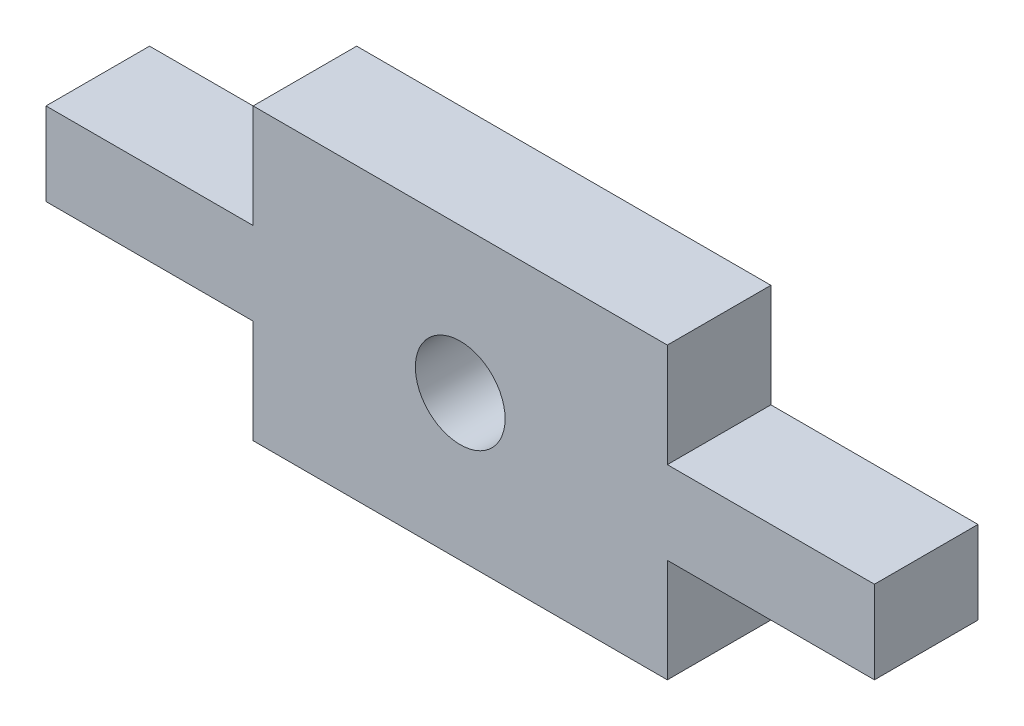
ISO-10303-21;
HEADER;
FILE_DESCRIPTION(('STEP AP214'),'2;1');
FILE_NAME('part.step','',(''),(''),'','','');
FILE_SCHEMA(('AUTOMOTIVE_DESIGN { 1 0 10303 214 1 1 1 1 }'));
ENDSEC;
DATA;
#1=APPLICATION_CONTEXT('core data for automotive mechanical design processes');
#2=APPLICATION_PROTOCOL_DEFINITION('international standard','automotive_design',2000,#1);
#3=PRODUCT_CONTEXT('',#1,'mechanical');
#4=PRODUCT('Part','Part','',(#3));
#5=PRODUCT_RELATED_PRODUCT_CATEGORY('part','',(#4));
#6=PRODUCT_DEFINITION_FORMATION('','',#4);
#7=PRODUCT_DEFINITION_CONTEXT('part definition',#1,'design');
#8=PRODUCT_DEFINITION('design','',#6,#7);
#9=PRODUCT_DEFINITION_SHAPE('','',#8);
#10=(LENGTH_UNIT() NAMED_UNIT(*) SI_UNIT(.MILLI.,.METRE.));
#11=(NAMED_UNIT(*) PLANE_ANGLE_UNIT() SI_UNIT($,.RADIAN.));
#12=(NAMED_UNIT(*) SI_UNIT($,.STERADIAN.) SOLID_ANGLE_UNIT());
#13=UNCERTAINTY_MEASURE_WITH_UNIT(LENGTH_MEASURE(1.E-05),#10,'distance_accuracy_value','');
#14=(GEOMETRIC_REPRESENTATION_CONTEXT(3) GLOBAL_UNCERTAINTY_ASSIGNED_CONTEXT((#13)) GLOBAL_UNIT_ASSIGNED_CONTEXT((#10,
#11,#12)) REPRESENTATION_CONTEXT('',''));
#15=CARTESIAN_POINT('',(0.,0.,0.));
#16=DIRECTION('',(0.,0.,1.));
#17=DIRECTION('',(1.,0.,0.));
#18=AXIS2_PLACEMENT_3D('',#15,#16,#17);
#19=CARTESIAN_POINT('',(0.,0.,3.));
#20=DIRECTION('',(0.,0.,-1.));
#21=DIRECTION('',(-1.,0.,0.));
#22=AXIS2_PLACEMENT_3D('',#19,#20,#21);
#23=PLANE('',#22);
#24=DIRECTION('',(0.,-1.,0.));
#25=VECTOR('',#24,1.);
#26=CARTESIAN_POINT('',(47.9999736591955,38.2000662736907,3.));
#27=LINE('',#26,#25);
#28=CARTESIAN_POINT('',(47.9999736591955,38.2000662736907,3.));
#29=VERTEX_POINT('',#28);
#30=CARTESIAN_POINT('',(47.9999736591955,35.8000044369874,3.));
#31=VERTEX_POINT('',#30);
#32=EDGE_CURVE('E177',#29,#31,#27,.T.);
#33=ORIENTED_EDGE('',*,*,#32,.T.);
#34=DIRECTION('',(0.999999999930556,1.17850871429143E-05,0.));
#35=VECTOR('',#34,1.);
#36=CARTESIAN_POINT('',(47.9999736591955,35.8000044369874,3.));
#37=LINE('',#36,#35);
#38=CARTESIAN_POINT('',(53.9999868295979,35.8000751476655,3.));
#39=VERTEX_POINT('',#38);
#40=EDGE_CURVE('E105',#31,#39,#37,.T.);
#41=ORIENTED_EDGE('',*,*,#40,.T.);
#42=DIRECTION('',(4.71386819660799E-05,-0.999999998888972,0.));
#43=VECTOR('',#42,1.);
#44=CARTESIAN_POINT('',(53.9999868295979,35.8000751476655,3.));
#45=LINE('',#44,#43);
#46=CARTESIAN_POINT('',(54.0001282509541,32.7999624964473,3.));
#47=VERTEX_POINT('',#46);
#48=EDGE_CURVE('E204',#39,#47,#45,.T.);
#49=ORIENTED_EDGE('',*,*,#48,.T.);
#50=DIRECTION('',(1.,0.,0.));
#51=VECTOR('',#50,1.);
#52=CARTESIAN_POINT('',(66.0000131704022,32.7999624964472,3.));
#53=LINE('',#52,#51);
#54=CARTESIAN_POINT('',(66.0000131704022,32.7999624964472,3.));
#55=VERTEX_POINT('',#54);
#56=EDGE_CURVE('E223',#47,#55,#53,.T.);
#57=ORIENTED_EDGE('',*,*,#56,.T.);
#58=DIRECTION('',(0.,1.,0.));
#59=VECTOR('',#58,1.);
#60=CARTESIAN_POINT('',(66.0000131704022,35.8000751476655,3.));
#61=LINE('',#60,#59);
#62=CARTESIAN_POINT('',(66.0000131704022,35.8000751476655,3.));
#63=VERTEX_POINT('',#62);
#64=EDGE_CURVE('E220',#55,#63,#61,.T.);
#65=ORIENTED_EDGE('',*,*,#64,.T.);
#66=DIRECTION('',(0.999999999930556,-1.17850871429145E-05,0.));
#67=VECTOR('',#66,1.);
#68=CARTESIAN_POINT('',(66.0000131704022,35.8000751476655,3.));
#69=LINE('',#68,#67);
#70=CARTESIAN_POINT('',(72.0000263408045,35.8000044369874,3.));
#71=VERTEX_POINT('',#70);
#72=EDGE_CURVE('E222',#63,#71,#69,.T.);
#73=ORIENTED_EDGE('',*,*,#72,.T.);
#74=DIRECTION('',(0.,1.,0.));
#75=VECTOR('',#74,1.);
#76=CARTESIAN_POINT('',(72.0000263408045,38.2000662736908,3.));
#77=LINE('',#76,#75);
#78=CARTESIAN_POINT('',(72.0000263408045,38.2000662736908,3.));
#79=VERTEX_POINT('',#78);
#80=EDGE_CURVE('E225',#71,#79,#77,.T.);
#81=ORIENTED_EDGE('',*,*,#80,.T.);
#82=DIRECTION('',(-0.999999999722217,-2.35704484027615E-05,0.));
#83=VECTOR('',#82,1.);
#84=CARTESIAN_POINT('',(66.0000838810803,38.1999248523566,3.));
#85=LINE('',#84,#83);
#86=CARTESIAN_POINT('',(66.0000838810803,38.1999248523566,3.));
#87=VERTEX_POINT('',#86);
#88=EDGE_CURVE('E231',#79,#87,#85,.T.);
#89=ORIENTED_EDGE('',*,*,#88,.T.);
#90=DIRECTION('',(-2.35698965170594E-05,0.99999999972223,0.));
#91=VECTOR('',#90,1.);
#92=CARTESIAN_POINT('',(66.0000838810803,38.1999248523566,3.));
#93=LINE('',#92,#91);
#94=CARTESIAN_POINT('',(66.0000131704022,41.1999667928747,3.));
#95=VERTEX_POINT('',#94);
#96=EDGE_CURVE('E136',#87,#95,#93,.T.);
#97=ORIENTED_EDGE('',*,*,#96,.T.);
#98=DIRECTION('',(-0.999999999982639,5.89257829808623E-06,0.));
#99=VECTOR('',#98,1.);
#100=CARTESIAN_POINT('',(66.0000131704022,41.1999667928747,3.));
#101=LINE('',#100,#99);
#102=CARTESIAN_POINT('',(54.0000575402759,41.2000375035528,3.));
#103=VERTEX_POINT('',#102);
#104=EDGE_CURVE('E130',#95,#103,#101,.T.);
#105=ORIENTED_EDGE('',*,*,#104,.T.);
#106=DIRECTION('',(-2.35698965526502E-05,-0.99999999972223,0.));
#107=VECTOR('',#106,1.);
#108=CARTESIAN_POINT('',(54.0000575402759,41.2000375035528,3.));
#109=LINE('',#108,#107);
#110=CARTESIAN_POINT('',(53.9999868295977,38.1999955628545,3.));
#111=VERTEX_POINT('',#110);
#112=EDGE_CURVE('E134',#103,#111,#109,.T.);
#113=ORIENTED_EDGE('',*,*,#112,.T.);
#114=DIRECTION('',(-0.999999999930556,1.17851134979322E-05,0.));
#115=VECTOR('',#114,1.);
#116=CARTESIAN_POINT('',(47.9999736591955,38.2000662736907,3.));
#117=LINE('',#116,#115);
#118=EDGE_CURVE('E50',#111,#29,#117,.T.);
#119=ORIENTED_EDGE('',*,*,#118,.T.);
#120=EDGE_LOOP('',(#33,#41,#49,#57,#65,#73,#81,#89,#97,#105,#113,#119));
#121=FACE_BOUND('',#120,.T.);
#122=CARTESIAN_POINT('',(60.0000707106777,36.999964644661,3.));
#123=DIRECTION('',(0.,0.,1.));
#124=DIRECTION('',(1.,0.,0.));
#125=AXIS2_PLACEMENT_3D('',#122,#123,#124);
#126=CIRCLE('',#125,1.29995000096183);
#127=CARTESIAN_POINT('',(61.3000207116396,36.999964644661,3.));
#128=VERTEX_POINT('',#127);
#129=EDGE_CURVE('E158',#128,#128,#126,.T.);
#130=ORIENTED_EDGE('',*,*,#129,.F.);
#131=EDGE_LOOP('',(#130));
#132=FACE_BOUND('',#131,.T.);
#133=ADVANCED_FACE('F33',(#121,#132),#23,.F.);
#134=CARTESIAN_POINT('',(0.,0.,0.));
#135=DIRECTION('',(0.,0.,-1.));
#136=DIRECTION('',(-1.,0.,0.));
#137=AXIS2_PLACEMENT_3D('',#134,#135,#136);
#138=PLANE('',#137);
#139=DIRECTION('',(0.,-1.,0.));
#140=VECTOR('',#139,1.);
#141=CARTESIAN_POINT('',(47.9999736591955,38.2000662736907,0.));
#142=LINE('',#141,#140);
#143=CARTESIAN_POINT('',(47.9999736591955,38.2000662736907,0.));
#144=VERTEX_POINT('',#143);
#145=CARTESIAN_POINT('',(47.9999736591955,35.8000044369874,0.));
#146=VERTEX_POINT('',#145);
#147=EDGE_CURVE('E154',#144,#146,#142,.T.);
#148=ORIENTED_EDGE('',*,*,#147,.F.);
#149=DIRECTION('',(-0.999999999930556,1.17851134979322E-05,0.));
#150=VECTOR('',#149,1.);
#151=CARTESIAN_POINT('',(47.9999736591955,38.2000662736907,0.));
#152=LINE('',#151,#150);
#153=CARTESIAN_POINT('',(53.9999868295977,38.1999955628545,0.));
#154=VERTEX_POINT('',#153);
#155=EDGE_CURVE('E97',#154,#144,#152,.T.);
#156=ORIENTED_EDGE('',*,*,#155,.F.);
#157=DIRECTION('',(-2.35698965526502E-05,-0.99999999972223,0.));
#158=VECTOR('',#157,1.);
#159=CARTESIAN_POINT('',(54.0000575402759,41.2000375035528,0.));
#160=LINE('',#159,#158);
#161=CARTESIAN_POINT('',(54.0000575402759,41.2000375035528,0.));
#162=VERTEX_POINT('',#161);
#163=EDGE_CURVE('E91',#162,#154,#160,.T.);
#164=ORIENTED_EDGE('',*,*,#163,.F.);
#165=DIRECTION('',(-0.999999999982639,5.89257829808623E-06,0.));
#166=VECTOR('',#165,1.);
#167=CARTESIAN_POINT('',(66.0000131704022,41.1999667928747,0.));
#168=LINE('',#167,#166);
#169=CARTESIAN_POINT('',(66.0000131704022,41.1999667928747,0.));
#170=VERTEX_POINT('',#169);
#171=EDGE_CURVE('E144',#170,#162,#168,.T.);
#172=ORIENTED_EDGE('',*,*,#171,.F.);
#173=DIRECTION('',(-2.35698965170594E-05,0.99999999972223,0.));
#174=VECTOR('',#173,1.);
#175=CARTESIAN_POINT('',(66.0000838810803,38.1999248523566,0.));
#176=LINE('',#175,#174);
#177=CARTESIAN_POINT('',(66.0000838810803,38.1999248523566,0.));
#178=VERTEX_POINT('',#177);
#179=EDGE_CURVE('E172',#178,#170,#176,.T.);
#180=ORIENTED_EDGE('',*,*,#179,.F.);
#181=DIRECTION('',(-0.999999999722217,-2.35704484027615E-05,0.));
#182=VECTOR('',#181,1.);
#183=CARTESIAN_POINT('',(66.0000838810803,38.1999248523566,0.));
#184=LINE('',#183,#182);
#185=CARTESIAN_POINT('',(72.0000263408045,38.2000662736908,0.));
#186=VERTEX_POINT('',#185);
#187=EDGE_CURVE('E170',#186,#178,#184,.T.);
#188=ORIENTED_EDGE('',*,*,#187,.F.);
#189=DIRECTION('',(0.,1.,0.));
#190=VECTOR('',#189,1.);
#191=CARTESIAN_POINT('',(72.0000263408045,38.2000662736908,0.));
#192=LINE('',#191,#190);
#193=CARTESIAN_POINT('',(72.0000263408045,35.8000044369874,0.));
#194=VERTEX_POINT('',#193);
#195=EDGE_CURVE('E168',#194,#186,#192,.T.);
#196=ORIENTED_EDGE('',*,*,#195,.F.);
#197=DIRECTION('',(0.999999999930556,-1.17850871429145E-05,0.));
#198=VECTOR('',#197,1.);
#199=CARTESIAN_POINT('',(66.0000131704022,35.8000751476655,0.));
#200=LINE('',#199,#198);
#201=CARTESIAN_POINT('',(66.0000131704022,35.8000751476655,0.));
#202=VERTEX_POINT('',#201);
#203=EDGE_CURVE('E166',#202,#194,#200,.T.);
#204=ORIENTED_EDGE('',*,*,#203,.F.);
#205=DIRECTION('',(0.,1.,0.));
#206=VECTOR('',#205,1.);
#207=CARTESIAN_POINT('',(66.0000131704022,35.8000751476655,0.));
#208=LINE('',#207,#206);
#209=CARTESIAN_POINT('',(66.0000131704022,32.7999624964472,0.));
#210=VERTEX_POINT('',#209);
#211=EDGE_CURVE('E164',#210,#202,#208,.T.);
#212=ORIENTED_EDGE('',*,*,#211,.F.);
#213=DIRECTION('',(1.,0.,0.));
#214=VECTOR('',#213,1.);
#215=CARTESIAN_POINT('',(66.0000131704022,32.7999624964472,0.));
#216=LINE('',#215,#214);
#217=CARTESIAN_POINT('',(54.0001282509541,32.7999624964473,0.));
#218=VERTEX_POINT('',#217);
#219=EDGE_CURVE('E162',#218,#210,#216,.T.);
#220=ORIENTED_EDGE('',*,*,#219,.F.);
#221=DIRECTION('',(4.71386819660799E-05,-0.999999998888972,0.));
#222=VECTOR('',#221,1.);
#223=CARTESIAN_POINT('',(53.9999868295979,35.8000751476655,0.));
#224=LINE('',#223,#222);
#225=CARTESIAN_POINT('',(53.9999868295979,35.8000751476655,0.));
#226=VERTEX_POINT('',#225);
#227=EDGE_CURVE('E160',#226,#218,#224,.T.);
#228=ORIENTED_EDGE('',*,*,#227,.F.);
#229=DIRECTION('',(0.999999999930556,1.17850871429143E-05,0.));
#230=VECTOR('',#229,1.);
#231=CARTESIAN_POINT('',(47.9999736591955,35.8000044369874,0.));
#232=LINE('',#231,#230);
#233=EDGE_CURVE('E157',#146,#226,#232,.T.);
#234=ORIENTED_EDGE('',*,*,#233,.F.);
#235=EDGE_LOOP('',(#148,#156,#164,#172,#180,#188,#196,#204,#212,#220,#228,#234));
#236=FACE_BOUND('',#235,.T.);
#237=CARTESIAN_POINT('',(60.0000707106777,36.999964644661,0.));
#238=DIRECTION('',(0.,0.,1.));
#239=DIRECTION('',(1.,0.,0.));
#240=AXIS2_PLACEMENT_3D('',#237,#238,#239);
#241=CIRCLE('',#240,1.29995000096183);
#242=CARTESIAN_POINT('',(61.3000207116396,36.999964644661,0.));
#243=VERTEX_POINT('',#242);
#244=EDGE_CURVE('E378',#243,#243,#241,.T.);
#245=ORIENTED_EDGE('',*,*,#244,.T.);
#246=EDGE_LOOP('',(#245));
#247=FACE_BOUND('',#246,.T.);
#248=ADVANCED_FACE('F208',(#236,#247),#138,.T.);
#249=CARTESIAN_POINT('',(47.9999736591955,38.2000662736907,3.));
#250=DIRECTION('',(1.,0.,0.));
#251=DIRECTION('',(0.,0.,-1.));
#252=AXIS2_PLACEMENT_3D('',#249,#250,#251);
#253=PLANE('',#252);
#254=ORIENTED_EDGE('',*,*,#147,.T.);
#255=DIRECTION('',(0.,0.,-1.));
#256=VECTOR('',#255,1.);
#257=CARTESIAN_POINT('',(47.9999736591955,35.8000044369874,3.));
#258=LINE('',#257,#256);
#259=EDGE_CURVE('E11',#31,#146,#258,.T.);
#260=ORIENTED_EDGE('',*,*,#259,.F.);
#261=ORIENTED_EDGE('',*,*,#32,.F.);
#262=DIRECTION('',(0.,0.,-1.));
#263=VECTOR('',#262,1.);
#264=CARTESIAN_POINT('',(47.9999736591955,38.2000662736907,3.));
#265=LINE('',#264,#263);
#266=EDGE_CURVE('E150',#29,#144,#265,.T.);
#267=ORIENTED_EDGE('',*,*,#266,.T.);
#268=EDGE_LOOP('',(#254,#260,#261,#267));
#269=FACE_BOUND('',#268,.T.);
#270=ADVANCED_FACE('F35',(#269),#253,.F.);
#271=CARTESIAN_POINT('',(47.9999736591955,35.8000044369874,3.));
#272=DIRECTION('',(-1.17850871429143E-05,0.999999999930556,0.));
#273=DIRECTION('',(-0.999999999930556,-1.17850871429143E-05,0.));
#274=AXIS2_PLACEMENT_3D('',#271,#272,#273);
#275=PLANE('',#274);
#276=ORIENTED_EDGE('',*,*,#233,.T.);
#277=DIRECTION('',(0.,0.,-1.));
#278=VECTOR('',#277,1.);
#279=CARTESIAN_POINT('',(53.9999868295979,35.8000751476655,3.));
#280=LINE('',#279,#278);
#281=EDGE_CURVE('E42',#39,#226,#280,.T.);
#282=ORIENTED_EDGE('',*,*,#281,.F.);
#283=ORIENTED_EDGE('',*,*,#40,.F.);
#284=ORIENTED_EDGE('',*,*,#259,.T.);
#285=EDGE_LOOP('',(#276,#282,#283,#284));
#286=FACE_BOUND('',#285,.T.);
#287=ADVANCED_FACE('F265',(#286),#275,.F.);
#288=CARTESIAN_POINT('',(53.9999868295979,35.8000751476655,3.));
#289=DIRECTION('',(0.999999998888972,4.71386819660799E-05,0.));
#290=DIRECTION('',(-4.71386819660799E-05,0.999999998888972,0.));
#291=AXIS2_PLACEMENT_3D('',#288,#289,#290);
#292=PLANE('',#291);
#293=ORIENTED_EDGE('',*,*,#227,.T.);
#294=DIRECTION('',(0.,0.,-1.));
#295=VECTOR('',#294,1.);
#296=CARTESIAN_POINT('',(54.0001282509541,32.7999624964473,3.));
#297=LINE('',#296,#295);
#298=EDGE_CURVE('E196',#47,#218,#297,.T.);
#299=ORIENTED_EDGE('',*,*,#298,.F.);
#300=ORIENTED_EDGE('',*,*,#48,.F.);
#301=ORIENTED_EDGE('',*,*,#281,.T.);
#302=EDGE_LOOP('',(#293,#299,#300,#301));
#303=FACE_BOUND('',#302,.T.);
#304=ADVANCED_FACE('F202',(#303),#292,.F.);
#305=CARTESIAN_POINT('',(66.0000131704022,32.7999624964472,3.));
#306=DIRECTION('',(0.,1.,0.));
#307=DIRECTION('',(-1.,0.,0.));
#308=AXIS2_PLACEMENT_3D('',#305,#306,#307);
#309=PLANE('',#308);
#310=ORIENTED_EDGE('',*,*,#219,.T.);
#311=DIRECTION('',(0.,0.,-1.));
#312=VECTOR('',#311,1.);
#313=CARTESIAN_POINT('',(66.0000131704022,32.7999624964472,3.));
#314=LINE('',#313,#312);
#315=EDGE_CURVE('E193',#55,#210,#314,.T.);
#316=ORIENTED_EDGE('',*,*,#315,.F.);
#317=ORIENTED_EDGE('',*,*,#56,.F.);
#318=ORIENTED_EDGE('',*,*,#298,.T.);
#319=EDGE_LOOP('',(#310,#316,#317,#318));
#320=FACE_BOUND('',#319,.T.);
#321=ADVANCED_FACE('F214',(#320),#309,.F.);
#322=CARTESIAN_POINT('',(66.0000131704022,35.8000751476655,3.));
#323=DIRECTION('',(-1.,0.,0.));
#324=DIRECTION('',(0.,0.,1.));
#325=AXIS2_PLACEMENT_3D('',#322,#323,#324);
#326=PLANE('',#325);
#327=ORIENTED_EDGE('',*,*,#211,.T.);
#328=DIRECTION('',(0.,0.,-1.));
#329=VECTOR('',#328,1.);
#330=CARTESIAN_POINT('',(66.0000131704022,35.8000751476655,3.));
#331=LINE('',#330,#329);
#332=EDGE_CURVE('E190',#63,#202,#331,.T.);
#333=ORIENTED_EDGE('',*,*,#332,.F.);
#334=ORIENTED_EDGE('',*,*,#64,.F.);
#335=ORIENTED_EDGE('',*,*,#315,.T.);
#336=EDGE_LOOP('',(#327,#333,#334,#335));
#337=FACE_BOUND('',#336,.T.);
#338=ADVANCED_FACE('F218',(#337),#326,.F.);
#339=CARTESIAN_POINT('',(66.0000131704022,35.8000751476655,3.));
#340=DIRECTION('',(1.17850871429145E-05,0.999999999930556,0.));
#341=DIRECTION('',(-0.999999999930556,1.17850871429145E-05,0.));
#342=AXIS2_PLACEMENT_3D('',#339,#340,#341);
#343=PLANE('',#342);
#344=ORIENTED_EDGE('',*,*,#203,.T.);
#345=DIRECTION('',(0.,0.,-1.));
#346=VECTOR('',#345,1.);
#347=CARTESIAN_POINT('',(72.0000263408045,35.8000044369874,3.));
#348=LINE('',#347,#346);
#349=EDGE_CURVE('E187',#71,#194,#348,.T.);
#350=ORIENTED_EDGE('',*,*,#349,.F.);
#351=ORIENTED_EDGE('',*,*,#72,.F.);
#352=ORIENTED_EDGE('',*,*,#332,.T.);
#353=EDGE_LOOP('',(#344,#350,#351,#352));
#354=FACE_BOUND('',#353,.T.);
#355=ADVANCED_FACE('F278',(#354),#343,.F.);
#356=CARTESIAN_POINT('',(72.0000263408045,38.2000662736908,3.));
#357=DIRECTION('',(-1.,0.,0.));
#358=DIRECTION('',(0.,0.,1.));
#359=AXIS2_PLACEMENT_3D('',#356,#357,#358);
#360=PLANE('',#359);
#361=ORIENTED_EDGE('',*,*,#195,.T.);
#362=DIRECTION('',(0.,0.,-1.));
#363=VECTOR('',#362,1.);
#364=CARTESIAN_POINT('',(72.0000263408045,38.2000662736908,3.));
#365=LINE('',#364,#363);
#366=EDGE_CURVE('E184',#79,#186,#365,.T.);
#367=ORIENTED_EDGE('',*,*,#366,.F.);
#368=ORIENTED_EDGE('',*,*,#80,.F.);
#369=ORIENTED_EDGE('',*,*,#349,.T.);
#370=EDGE_LOOP('',(#361,#367,#368,#369));
#371=FACE_BOUND('',#370,.T.);
#372=ADVANCED_FACE('F281',(#371),#360,.F.);
#373=CARTESIAN_POINT('',(66.0000838810803,38.1999248523566,3.));
#374=DIRECTION('',(2.35704484027615E-05,-0.999999999722217,0.));
#375=DIRECTION('',(0.999999999722217,2.35704484027615E-05,0.));
#376=AXIS2_PLACEMENT_3D('',#373,#374,#375);
#377=PLANE('',#376);
#378=ORIENTED_EDGE('',*,*,#187,.T.);
#379=DIRECTION('',(0.,0.,-1.));
#380=VECTOR('',#379,1.);
#381=CARTESIAN_POINT('',(66.0000838810803,38.1999248523566,3.));
#382=LINE('',#381,#380);
#383=EDGE_CURVE('E181',#87,#178,#382,.T.);
#384=ORIENTED_EDGE('',*,*,#383,.F.);
#385=ORIENTED_EDGE('',*,*,#88,.F.);
#386=ORIENTED_EDGE('',*,*,#366,.T.);
#387=EDGE_LOOP('',(#378,#384,#385,#386));
#388=FACE_BOUND('',#387,.T.);
#389=ADVANCED_FACE('F237',(#388),#377,.F.);
#390=CARTESIAN_POINT('',(66.0000838810803,38.1999248523566,3.));
#391=DIRECTION('',(-0.99999999972223,-2.35698965170594E-05,0.));
#392=DIRECTION('',(2.35698965170594E-05,-0.99999999972223,0.));
#393=AXIS2_PLACEMENT_3D('',#390,#391,#392);
#394=PLANE('',#393);
#395=ORIENTED_EDGE('',*,*,#179,.T.);
#396=DIRECTION('',(0.,0.,-1.));
#397=VECTOR('',#396,1.);
#398=CARTESIAN_POINT('',(66.0000131704022,41.1999667928747,3.));
#399=LINE('',#398,#397);
#400=EDGE_CURVE('E145',#95,#170,#399,.T.);
#401=ORIENTED_EDGE('',*,*,#400,.F.);
#402=ORIENTED_EDGE('',*,*,#96,.F.);
#403=ORIENTED_EDGE('',*,*,#383,.T.);
#404=EDGE_LOOP('',(#395,#401,#402,#403));
#405=FACE_BOUND('',#404,.T.);
#406=ADVANCED_FACE('F241',(#405),#394,.F.);
#407=CARTESIAN_POINT('',(66.0000131704022,41.1999667928747,3.));
#408=DIRECTION('',(-5.89257829808623E-06,-0.999999999982639,0.));
#409=DIRECTION('',(0.999999999982639,-5.89257829808623E-06,0.));
#410=AXIS2_PLACEMENT_3D('',#407,#408,#409);
#411=PLANE('',#410);
#412=ORIENTED_EDGE('',*,*,#171,.T.);
#413=DIRECTION('',(0.,0.,-1.));
#414=VECTOR('',#413,1.);
#415=CARTESIAN_POINT('',(54.0000575402759,41.2000375035528,3.));
#416=LINE('',#415,#414);
#417=EDGE_CURVE('E141',#103,#162,#416,.T.);
#418=ORIENTED_EDGE('',*,*,#417,.F.);
#419=ORIENTED_EDGE('',*,*,#104,.F.);
#420=ORIENTED_EDGE('',*,*,#400,.T.);
#421=EDGE_LOOP('',(#412,#418,#419,#420));
#422=FACE_BOUND('',#421,.T.);
#423=ADVANCED_FACE('F142',(#422),#411,.F.);
#424=CARTESIAN_POINT('',(54.0000575402759,41.2000375035528,3.));
#425=DIRECTION('',(0.99999999972223,-2.35698965526502E-05,0.));
#426=DIRECTION('',(2.35698965526502E-05,0.99999999972223,0.));
#427=AXIS2_PLACEMENT_3D('',#424,#425,#426);
#428=PLANE('',#427);
#429=ORIENTED_EDGE('',*,*,#163,.T.);
#430=DIRECTION('',(0.,0.,-1.));
#431=VECTOR('',#430,1.);
#432=CARTESIAN_POINT('',(53.9999868295977,38.1999955628545,3.));
#433=LINE('',#432,#431);
#434=EDGE_CURVE('E146',#111,#154,#433,.T.);
#435=ORIENTED_EDGE('',*,*,#434,.F.);
#436=ORIENTED_EDGE('',*,*,#112,.F.);
#437=ORIENTED_EDGE('',*,*,#417,.T.);
#438=EDGE_LOOP('',(#429,#435,#436,#437));
#439=FACE_BOUND('',#438,.T.);
#440=ADVANCED_FACE('F148',(#439),#428,.F.);
#441=CARTESIAN_POINT('',(47.9999736591955,38.2000662736907,3.));
#442=DIRECTION('',(-1.17851134979322E-05,-0.999999999930556,0.));
#443=DIRECTION('',(0.999999999930556,-1.17851134979322E-05,0.));
#444=AXIS2_PLACEMENT_3D('',#441,#442,#443);
#445=PLANE('',#444);
#446=ORIENTED_EDGE('',*,*,#155,.T.);
#447=ORIENTED_EDGE('',*,*,#266,.F.);
#448=ORIENTED_EDGE('',*,*,#118,.F.);
#449=ORIENTED_EDGE('',*,*,#434,.T.);
#450=EDGE_LOOP('',(#446,#447,#448,#449));
#451=FACE_BOUND('',#450,.T.);
#452=ADVANCED_FACE('F245',(#451),#445,.F.);
#453=CARTESIAN_POINT('',(60.0000707106777,36.999964644661,3.));
#454=DIRECTION('',(0.,0.,-1.));
#455=DIRECTION('',(-1.,0.,0.));
#456=AXIS2_PLACEMENT_3D('',#453,#454,#455);
#457=CYLINDRICAL_SURFACE('',#456,1.29995000096183);
#458=ORIENTED_EDGE('',*,*,#129,.T.);
#459=EDGE_LOOP('',(#458));
#460=FACE_BOUND('',#459,.T.);
#461=ORIENTED_EDGE('',*,*,#244,.F.);
#462=EDGE_LOOP('',(#461));
#463=FACE_BOUND('',#462,.T.);
#464=ADVANCED_FACE('F247',(#460,#463),#457,.F.);
#465=CLOSED_SHELL('',(#133,#248,#270,#287,#304,#321,#338,#355,#372,#389,#406,#423,#440,#452,#464));
#466=MANIFOLD_SOLID_BREP('B2',#465);
#467=ADVANCED_BREP_SHAPE_REPRESENTATION('',(#18,#466),#14);
#468=SHAPE_DEFINITION_REPRESENTATION(#9,#467);
ENDSEC;
END-ISO-10303-21;
